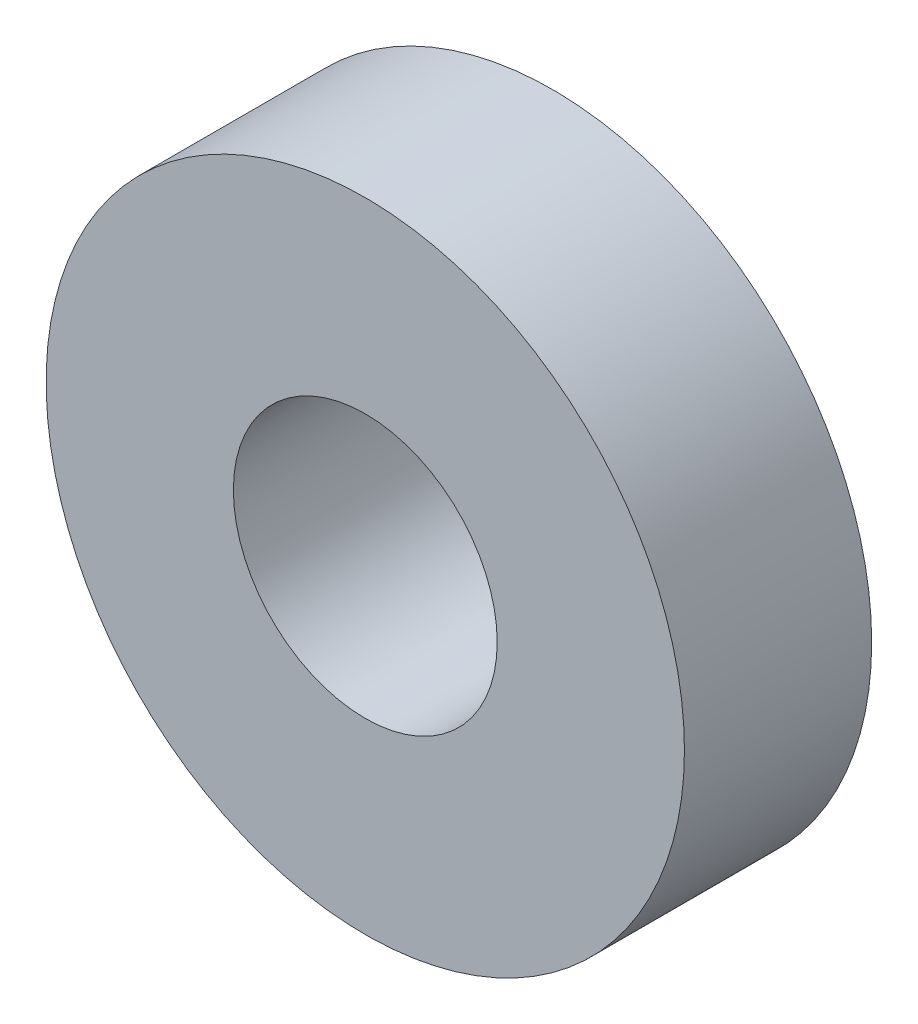
ISO-10303-21;
HEADER;
FILE_DESCRIPTION(('STEP AP214'),'2;1');
FILE_NAME('part.step','',(''),(''),'','','');
FILE_SCHEMA(('AUTOMOTIVE_DESIGN { 1 0 10303 214 1 1 1 1 }'));
ENDSEC;
DATA;
#1=APPLICATION_CONTEXT('core data for automotive mechanical design processes');
#2=APPLICATION_PROTOCOL_DEFINITION('international standard','automotive_design',2000,#1);
#3=PRODUCT_CONTEXT('',#1,'mechanical');
#4=PRODUCT('Part','Part','',(#3));
#5=PRODUCT_RELATED_PRODUCT_CATEGORY('part','',(#4));
#6=PRODUCT_DEFINITION_FORMATION('','',#4);
#7=PRODUCT_DEFINITION_CONTEXT('part definition',#1,'design');
#8=PRODUCT_DEFINITION('design','',#6,#7);
#9=PRODUCT_DEFINITION_SHAPE('','',#8);
#10=(LENGTH_UNIT() NAMED_UNIT(*) SI_UNIT(.MILLI.,.METRE.));
#11=(NAMED_UNIT(*) PLANE_ANGLE_UNIT() SI_UNIT($,.RADIAN.));
#12=(NAMED_UNIT(*) SI_UNIT($,.STERADIAN.) SOLID_ANGLE_UNIT());
#13=UNCERTAINTY_MEASURE_WITH_UNIT(LENGTH_MEASURE(1.E-05),#10,'distance_accuracy_value','');
#14=(GEOMETRIC_REPRESENTATION_CONTEXT(3) GLOBAL_UNCERTAINTY_ASSIGNED_CONTEXT((#13)) GLOBAL_UNIT_ASSIGNED_CONTEXT((#10,
#11,#12)) REPRESENTATION_CONTEXT('',''));
#15=CARTESIAN_POINT('',(0.,0.,0.));
#16=DIRECTION('',(0.,0.,1.));
#17=DIRECTION('',(1.,0.,0.));
#18=AXIS2_PLACEMENT_3D('',#15,#16,#17);
#19=CARTESIAN_POINT('',(0.,0.,-5.588));
#20=DIRECTION('',(0.,0.,1.));
#21=DIRECTION('',(1.,0.,0.));
#22=AXIS2_PLACEMENT_3D('',#19,#20,#21);
#23=CYLINDRICAL_SURFACE('',#22,3.937);
#24=CARTESIAN_POINT('',(0.,0.,0.));
#25=DIRECTION('',(0.,0.,1.));
#26=DIRECTION('',(1.,0.,0.));
#27=AXIS2_PLACEMENT_3D('',#24,#25,#26);
#28=CIRCLE('',#27,3.937);
#29=CARTESIAN_POINT('',(3.937,0.,0.));
#30=VERTEX_POINT('',#29);
#31=EDGE_CURVE('E18',#30,#30,#28,.F.);
#32=ORIENTED_EDGE('',*,*,#31,.F.);
#33=EDGE_LOOP('',(#32));
#34=FACE_BOUND('',#33,.T.);
#35=CARTESIAN_POINT('',(0.,0.,-5.588));
#36=DIRECTION('',(0.,0.,1.));
#37=DIRECTION('',(1.,0.,0.));
#38=AXIS2_PLACEMENT_3D('',#35,#36,#37);
#39=CIRCLE('',#38,3.937);
#40=CARTESIAN_POINT('',(3.937,0.,-5.588));
#41=VERTEX_POINT('',#40);
#42=EDGE_CURVE('E30',#41,#41,#39,.T.);
#43=ORIENTED_EDGE('',*,*,#42,.F.);
#44=EDGE_LOOP('',(#43));
#45=FACE_BOUND('',#44,.T.);
#46=ADVANCED_FACE('F15',(#34,#45),#23,.F.);
#47=CARTESIAN_POINT('',(0.,9.525,0.));
#48=DIRECTION('',(0.,0.,1.));
#49=DIRECTION('',(1.,0.,0.));
#50=AXIS2_PLACEMENT_3D('',#47,#48,#49);
#51=PLANE('',#50);
#52=CARTESIAN_POINT('',(0.,0.,0.));
#53=DIRECTION('',(0.,0.,1.));
#54=DIRECTION('',(1.,0.,0.));
#55=AXIS2_PLACEMENT_3D('',#52,#53,#54);
#56=CIRCLE('',#55,9.525);
#57=CARTESIAN_POINT('',(9.525,0.,0.));
#58=VERTEX_POINT('',#57);
#59=EDGE_CURVE('E23',#58,#58,#56,.F.);
#60=ORIENTED_EDGE('',*,*,#59,.F.);
#61=EDGE_LOOP('',(#60));
#62=FACE_BOUND('',#61,.T.);
#63=ORIENTED_EDGE('',*,*,#31,.T.);
#64=EDGE_LOOP('',(#63));
#65=FACE_BOUND('',#64,.T.);
#66=ADVANCED_FACE('F40',(#62,#65),#51,.T.);
#67=CARTESIAN_POINT('',(0.,3.937,-5.588));
#68=DIRECTION('',(0.,0.,-1.));
#69=DIRECTION('',(-1.,0.,0.));
#70=AXIS2_PLACEMENT_3D('',#67,#68,#69);
#71=PLANE('',#70);
#72=ORIENTED_EDGE('',*,*,#42,.T.);
#73=EDGE_LOOP('',(#72));
#74=FACE_BOUND('',#73,.T.);
#75=CARTESIAN_POINT('',(0.,0.,-5.588));
#76=DIRECTION('',(0.,0.,1.));
#77=DIRECTION('',(1.,0.,0.));
#78=AXIS2_PLACEMENT_3D('',#75,#76,#77);
#79=CIRCLE('',#78,9.525);
#80=CARTESIAN_POINT('',(9.525,0.,-5.588));
#81=VERTEX_POINT('',#80);
#82=EDGE_CURVE('E10',#81,#81,#79,.T.);
#83=ORIENTED_EDGE('',*,*,#82,.F.);
#84=EDGE_LOOP('',(#83));
#85=FACE_BOUND('',#84,.T.);
#86=ADVANCED_FACE('F48',(#74,#85),#71,.T.);
#87=CARTESIAN_POINT('',(0.,0.,-5.588));
#88=DIRECTION('',(0.,0.,1.));
#89=DIRECTION('',(1.,0.,0.));
#90=AXIS2_PLACEMENT_3D('',#87,#88,#89);
#91=CYLINDRICAL_SURFACE('',#90,9.525);
#92=ORIENTED_EDGE('',*,*,#82,.T.);
#93=EDGE_LOOP('',(#92));
#94=FACE_BOUND('',#93,.T.);
#95=ORIENTED_EDGE('',*,*,#59,.T.);
#96=EDGE_LOOP('',(#95));
#97=FACE_BOUND('',#96,.T.);
#98=ADVANCED_FACE('F50',(#94,#97),#91,.T.);
#99=CLOSED_SHELL('',(#46,#66,#86,#98));
#100=MANIFOLD_SOLID_BREP('B1',#99);
#101=ADVANCED_BREP_SHAPE_REPRESENTATION('',(#18,#100),#14);
#102=SHAPE_DEFINITION_REPRESENTATION(#9,#101);
ENDSEC;
END-ISO-10303-21;
